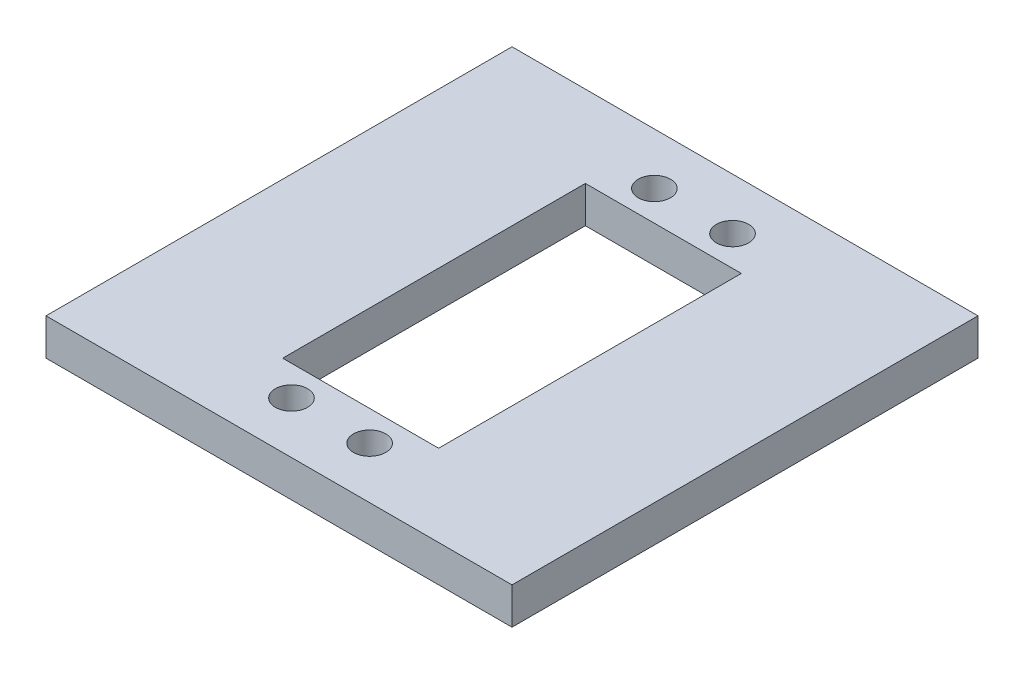
ISO-10303-21;
HEADER;
FILE_DESCRIPTION(('STEP AP214'),'2;1');
FILE_NAME('part.step','',(''),(''),'','','');
FILE_SCHEMA(('AUTOMOTIVE_DESIGN { 1 0 10303 214 1 1 1 1 }'));
ENDSEC;
DATA;
#1=APPLICATION_CONTEXT('core data for automotive mechanical design processes');
#2=APPLICATION_PROTOCOL_DEFINITION('international standard','automotive_design',2000,#1);
#3=PRODUCT_CONTEXT('',#1,'mechanical');
#4=PRODUCT('Part','Part','',(#3));
#5=PRODUCT_RELATED_PRODUCT_CATEGORY('part','',(#4));
#6=PRODUCT_DEFINITION_FORMATION('','',#4);
#7=PRODUCT_DEFINITION_CONTEXT('part definition',#1,'design');
#8=PRODUCT_DEFINITION('design','',#6,#7);
#9=PRODUCT_DEFINITION_SHAPE('','',#8);
#10=(LENGTH_UNIT() NAMED_UNIT(*) SI_UNIT(.MILLI.,.METRE.));
#11=(NAMED_UNIT(*) PLANE_ANGLE_UNIT() SI_UNIT($,.RADIAN.));
#12=(NAMED_UNIT(*) SI_UNIT($,.STERADIAN.) SOLID_ANGLE_UNIT());
#13=UNCERTAINTY_MEASURE_WITH_UNIT(LENGTH_MEASURE(1.E-05),#10,'distance_accuracy_value','');
#14=(GEOMETRIC_REPRESENTATION_CONTEXT(3) GLOBAL_UNCERTAINTY_ASSIGNED_CONTEXT((#13)) GLOBAL_UNIT_ASSIGNED_CONTEXT((#10,
#11,#12)) REPRESENTATION_CONTEXT('',''));
#15=CARTESIAN_POINT('',(0.,0.,0.));
#16=DIRECTION('',(0.,0.,1.));
#17=DIRECTION('',(1.,0.,0.));
#18=AXIS2_PLACEMENT_3D('',#15,#16,#17);
#19=CARTESIAN_POINT('',(31.75,5.,31.75));
#20=DIRECTION('',(-1.,0.,0.));
#21=DIRECTION('',(0.,0.,1.));
#22=AXIS2_PLACEMENT_3D('',#19,#20,#21);
#23=PLANE('',#22);
#24=DIRECTION('',(0.,0.,-1.));
#25=VECTOR('',#24,1.);
#26=CARTESIAN_POINT('',(31.75,0.,31.75));
#27=LINE('',#26,#25);
#28=CARTESIAN_POINT('',(31.75,0.,31.75));
#29=VERTEX_POINT('',#28);
#30=CARTESIAN_POINT('',(31.75,0.,-31.75));
#31=VERTEX_POINT('',#30);
#32=EDGE_CURVE('E157',#29,#31,#27,.T.);
#33=ORIENTED_EDGE('',*,*,#32,.T.);
#34=DIRECTION('',(0.,-1.,0.));
#35=VECTOR('',#34,1.);
#36=CARTESIAN_POINT('',(31.75,5.,-31.75));
#37=LINE('',#36,#35);
#38=CARTESIAN_POINT('',(31.75,5.,-31.75));
#39=VERTEX_POINT('',#38);
#40=EDGE_CURVE('E11',#39,#31,#37,.T.);
#41=ORIENTED_EDGE('',*,*,#40,.F.);
#42=DIRECTION('',(0.,0.,-1.));
#43=VECTOR('',#42,1.);
#44=CARTESIAN_POINT('',(31.75,5.,31.75));
#45=LINE('',#44,#43);
#46=CARTESIAN_POINT('',(31.75,5.,31.75));
#47=VERTEX_POINT('',#46);
#48=EDGE_CURVE('E163',#47,#39,#45,.T.);
#49=ORIENTED_EDGE('',*,*,#48,.F.);
#50=DIRECTION('',(0.,-1.,0.));
#51=VECTOR('',#50,1.);
#52=CARTESIAN_POINT('',(31.75,5.,31.75));
#53=LINE('',#52,#51);
#54=EDGE_CURVE('E177',#47,#29,#53,.T.);
#55=ORIENTED_EDGE('',*,*,#54,.T.);
#56=EDGE_LOOP('',(#33,#41,#49,#55));
#57=FACE_BOUND('',#56,.T.);
#58=ADVANCED_FACE('F45',(#57),#23,.F.);
#59=CARTESIAN_POINT('',(-31.75,5.,-31.75));
#60=DIRECTION('',(0.,0.,1.));
#61=DIRECTION('',(1.,0.,0.));
#62=AXIS2_PLACEMENT_3D('',#59,#60,#61);
#63=PLANE('',#62);
#64=DIRECTION('',(-1.,0.,0.));
#65=VECTOR('',#64,1.);
#66=CARTESIAN_POINT('',(-31.75,0.,-31.75));
#67=LINE('',#66,#65);
#68=CARTESIAN_POINT('',(-31.75,0.,-31.75));
#69=VERTEX_POINT('',#68);
#70=EDGE_CURVE('E181',#31,#69,#67,.T.);
#71=ORIENTED_EDGE('',*,*,#70,.T.);
#72=DIRECTION('',(0.,-1.,0.));
#73=VECTOR('',#72,1.);
#74=CARTESIAN_POINT('',(-31.75,5.,-31.75));
#75=LINE('',#74,#73);
#76=CARTESIAN_POINT('',(-31.75,5.,-31.75));
#77=VERTEX_POINT('',#76);
#78=EDGE_CURVE('E53',#77,#69,#75,.T.);
#79=ORIENTED_EDGE('',*,*,#78,.F.);
#80=DIRECTION('',(-1.,0.,0.));
#81=VECTOR('',#80,1.);
#82=CARTESIAN_POINT('',(-31.75,5.,-31.75));
#83=LINE('',#82,#81);
#84=EDGE_CURVE('E167',#39,#77,#83,.T.);
#85=ORIENTED_EDGE('',*,*,#84,.F.);
#86=ORIENTED_EDGE('',*,*,#40,.T.);
#87=EDGE_LOOP('',(#71,#79,#85,#86));
#88=FACE_BOUND('',#87,.T.);
#89=ADVANCED_FACE('F215',(#88),#63,.F.);
#90=CARTESIAN_POINT('',(-31.75,5.,31.75));
#91=DIRECTION('',(1.,0.,0.));
#92=DIRECTION('',(0.,0.,-1.));
#93=AXIS2_PLACEMENT_3D('',#90,#91,#92);
#94=PLANE('',#93);
#95=DIRECTION('',(0.,0.,1.));
#96=VECTOR('',#95,1.);
#97=CARTESIAN_POINT('',(-31.75,0.,31.75));
#98=LINE('',#97,#96);
#99=CARTESIAN_POINT('',(-31.75,0.,31.75));
#100=VERTEX_POINT('',#99);
#101=EDGE_CURVE('E184',#69,#100,#98,.T.);
#102=ORIENTED_EDGE('',*,*,#101,.T.);
#103=DIRECTION('',(0.,-1.,0.));
#104=VECTOR('',#103,1.);
#105=CARTESIAN_POINT('',(-31.75,5.,31.75));
#106=LINE('',#105,#104);
#107=CARTESIAN_POINT('',(-31.75,5.,31.75));
#108=VERTEX_POINT('',#107);
#109=EDGE_CURVE('E192',#108,#100,#106,.T.);
#110=ORIENTED_EDGE('',*,*,#109,.F.);
#111=DIRECTION('',(0.,0.,1.));
#112=VECTOR('',#111,1.);
#113=CARTESIAN_POINT('',(-31.75,5.,31.75));
#114=LINE('',#113,#112);
#115=EDGE_CURVE('E171',#77,#108,#114,.T.);
#116=ORIENTED_EDGE('',*,*,#115,.F.);
#117=ORIENTED_EDGE('',*,*,#78,.T.);
#118=EDGE_LOOP('',(#102,#110,#116,#117));
#119=FACE_BOUND('',#118,.T.);
#120=ADVANCED_FACE('F201',(#119),#94,.F.);
#121=CARTESIAN_POINT('',(-31.75,5.,31.75));
#122=DIRECTION('',(0.,0.,-1.));
#123=DIRECTION('',(-1.,0.,0.));
#124=AXIS2_PLACEMENT_3D('',#121,#122,#123);
#125=PLANE('',#124);
#126=DIRECTION('',(1.,0.,0.));
#127=VECTOR('',#126,1.);
#128=CARTESIAN_POINT('',(-31.75,0.,31.75));
#129=LINE('',#128,#127);
#130=EDGE_CURVE('E168',#100,#29,#129,.T.);
#131=ORIENTED_EDGE('',*,*,#130,.T.);
#132=ORIENTED_EDGE('',*,*,#54,.F.);
#133=DIRECTION('',(1.,0.,0.));
#134=VECTOR('',#133,1.);
#135=CARTESIAN_POINT('',(-31.75,5.,31.75));
#136=LINE('',#135,#134);
#137=EDGE_CURVE('E174',#108,#47,#136,.T.);
#138=ORIENTED_EDGE('',*,*,#137,.F.);
#139=ORIENTED_EDGE('',*,*,#109,.T.);
#140=EDGE_LOOP('',(#131,#132,#138,#139));
#141=FACE_BOUND('',#140,.T.);
#142=ADVANCED_FACE('F208',(#141),#125,.F.);
#143=CARTESIAN_POINT('',(0.,5.,0.));
#144=DIRECTION('',(0.,-1.,0.));
#145=DIRECTION('',(0.,0.,-1.));
#146=AXIS2_PLACEMENT_3D('',#143,#144,#145);
#147=PLANE('',#146);
#148=CARTESIAN_POINT('',(-5.325,5.,24.725));
#149=DIRECTION('',(0.,1.,0.));
#150=DIRECTION('',(0.,0.,1.));
#151=AXIS2_PLACEMENT_3D('',#148,#149,#150);
#152=CIRCLE('',#151,2.2);
#153=CARTESIAN_POINT('',(-5.325,5.,26.925));
#154=VERTEX_POINT('',#153);
#155=EDGE_CURVE('E286',#154,#154,#152,.T.);
#156=ORIENTED_EDGE('',*,*,#155,.F.);
#157=EDGE_LOOP('',(#156));
#158=FACE_BOUND('',#157,.T.);
#159=CARTESIAN_POINT('',(5.325,5.,24.725));
#160=DIRECTION('',(0.,1.,0.));
#161=DIRECTION('',(0.,0.,-1.));
#162=AXIS2_PLACEMENT_3D('',#159,#160,#161);
#163=CIRCLE('',#162,2.2);
#164=CARTESIAN_POINT('',(5.325,5.,22.525));
#165=VERTEX_POINT('',#164);
#166=EDGE_CURVE('E279',#165,#165,#163,.T.);
#167=ORIENTED_EDGE('',*,*,#166,.F.);
#168=EDGE_LOOP('',(#167));
#169=FACE_BOUND('',#168,.T.);
#170=CARTESIAN_POINT('',(-5.325,5.,-24.725));
#171=DIRECTION('',(0.,1.,0.));
#172=DIRECTION('',(0.,0.,-1.));
#173=AXIS2_PLACEMENT_3D('',#170,#171,#172);
#174=CIRCLE('',#173,2.2);
#175=CARTESIAN_POINT('',(-5.325,5.,-26.925));
#176=VERTEX_POINT('',#175);
#177=EDGE_CURVE('E269',#176,#176,#174,.T.);
#178=ORIENTED_EDGE('',*,*,#177,.F.);
#179=EDGE_LOOP('',(#178));
#180=FACE_BOUND('',#179,.T.);
#181=CARTESIAN_POINT('',(5.325,5.,-24.725));
#182=DIRECTION('',(0.,1.,0.));
#183=DIRECTION('',(0.,0.,1.));
#184=AXIS2_PLACEMENT_3D('',#181,#182,#183);
#185=CIRCLE('',#184,2.2);
#186=CARTESIAN_POINT('',(5.325,5.,-22.525));
#187=VERTEX_POINT('',#186);
#188=EDGE_CURVE('E148',#187,#187,#185,.T.);
#189=ORIENTED_EDGE('',*,*,#188,.F.);
#190=EDGE_LOOP('',(#189));
#191=FACE_BOUND('',#190,.T.);
#192=DIRECTION('',(-1.,0.,0.));
#193=VECTOR('',#192,1.);
#194=CARTESIAN_POINT('',(-10.625,5.,-20.625));
#195=LINE('',#194,#193);
#196=CARTESIAN_POINT('',(10.625,5.,-20.625));
#197=VERTEX_POINT('',#196);
#198=CARTESIAN_POINT('',(-10.625,5.,-20.625));
#199=VERTEX_POINT('',#198);
#200=EDGE_CURVE('E147',#197,#199,#195,.T.);
#201=ORIENTED_EDGE('',*,*,#200,.F.);
#202=DIRECTION('',(0.,0.,-1.));
#203=VECTOR('',#202,1.);
#204=CARTESIAN_POINT('',(10.625,5.,20.625));
#205=LINE('',#204,#203);
#206=CARTESIAN_POINT('',(10.625,5.,20.625));
#207=VERTEX_POINT('',#206);
#208=EDGE_CURVE('E60',#207,#197,#205,.T.);
#209=ORIENTED_EDGE('',*,*,#208,.F.);
#210=DIRECTION('',(1.,0.,0.));
#211=VECTOR('',#210,1.);
#212=CARTESIAN_POINT('',(-10.625,5.,20.625));
#213=LINE('',#212,#211);
#214=CARTESIAN_POINT('',(-10.625,5.,20.625));
#215=VERTEX_POINT('',#214);
#216=EDGE_CURVE('E131',#215,#207,#213,.T.);
#217=ORIENTED_EDGE('',*,*,#216,.F.);
#218=DIRECTION('',(0.,0.,1.));
#219=VECTOR('',#218,1.);
#220=CARTESIAN_POINT('',(-10.625,5.,20.625));
#221=LINE('',#220,#219);
#222=EDGE_CURVE('E135',#199,#215,#221,.T.);
#223=ORIENTED_EDGE('',*,*,#222,.F.);
#224=EDGE_LOOP('',(#201,#209,#217,#223));
#225=FACE_BOUND('',#224,.T.);
#226=ORIENTED_EDGE('',*,*,#48,.T.);
#227=ORIENTED_EDGE('',*,*,#84,.T.);
#228=ORIENTED_EDGE('',*,*,#115,.T.);
#229=ORIENTED_EDGE('',*,*,#137,.T.);
#230=EDGE_LOOP('',(#226,#227,#228,#229));
#231=FACE_BOUND('',#230,.T.);
#232=ADVANCED_FACE('F214',(#158,#169,#180,#191,#225,#231),#147,.F.);
#233=CARTESIAN_POINT('',(0.,0.,0.));
#234=DIRECTION('',(0.,-1.,0.));
#235=DIRECTION('',(0.,0.,-1.));
#236=AXIS2_PLACEMENT_3D('',#233,#234,#235);
#237=PLANE('',#236);
#238=CARTESIAN_POINT('',(-5.325,0.,24.725));
#239=DIRECTION('',(0.,1.,0.));
#240=DIRECTION('',(0.,0.,1.));
#241=AXIS2_PLACEMENT_3D('',#238,#239,#240);
#242=CIRCLE('',#241,2.2);
#243=CARTESIAN_POINT('',(-5.325,0.,26.925));
#244=VERTEX_POINT('',#243);
#245=EDGE_CURVE('E138',#244,#244,#242,.T.);
#246=ORIENTED_EDGE('',*,*,#245,.T.);
#247=EDGE_LOOP('',(#246));
#248=FACE_BOUND('',#247,.T.);
#249=CARTESIAN_POINT('',(5.325,0.,24.725));
#250=DIRECTION('',(0.,1.,0.));
#251=DIRECTION('',(0.,0.,-1.));
#252=AXIS2_PLACEMENT_3D('',#249,#250,#251);
#253=CIRCLE('',#252,2.2);
#254=CARTESIAN_POINT('',(5.325,0.,22.525));
#255=VERTEX_POINT('',#254);
#256=EDGE_CURVE('E283',#255,#255,#253,.T.);
#257=ORIENTED_EDGE('',*,*,#256,.T.);
#258=EDGE_LOOP('',(#257));
#259=FACE_BOUND('',#258,.T.);
#260=CARTESIAN_POINT('',(-5.325,0.,-24.725));
#261=DIRECTION('',(0.,1.,0.));
#262=DIRECTION('',(0.,0.,-1.));
#263=AXIS2_PLACEMENT_3D('',#260,#261,#262);
#264=CIRCLE('',#263,2.2);
#265=CARTESIAN_POINT('',(-5.325,0.,-26.925));
#266=VERTEX_POINT('',#265);
#267=EDGE_CURVE('E275',#266,#266,#264,.T.);
#268=ORIENTED_EDGE('',*,*,#267,.T.);
#269=EDGE_LOOP('',(#268));
#270=FACE_BOUND('',#269,.T.);
#271=CARTESIAN_POINT('',(5.325,0.,-24.725));
#272=DIRECTION('',(0.,1.,0.));
#273=DIRECTION('',(0.,0.,1.));
#274=AXIS2_PLACEMENT_3D('',#271,#272,#273);
#275=CIRCLE('',#274,2.2);
#276=CARTESIAN_POINT('',(5.325,0.,-22.525));
#277=VERTEX_POINT('',#276);
#278=EDGE_CURVE('E262',#277,#277,#275,.T.);
#279=ORIENTED_EDGE('',*,*,#278,.T.);
#280=EDGE_LOOP('',(#279));
#281=FACE_BOUND('',#280,.T.);
#282=DIRECTION('',(0.,0.,-1.));
#283=VECTOR('',#282,1.);
#284=CARTESIAN_POINT('',(10.625,0.,20.625));
#285=LINE('',#284,#283);
#286=CARTESIAN_POINT('',(10.625,0.,20.625));
#287=VERTEX_POINT('',#286);
#288=CARTESIAN_POINT('',(10.625,0.,-20.625));
#289=VERTEX_POINT('',#288);
#290=EDGE_CURVE('E112',#287,#289,#285,.T.);
#291=ORIENTED_EDGE('',*,*,#290,.T.);
#292=DIRECTION('',(-1.,0.,0.));
#293=VECTOR('',#292,1.);
#294=CARTESIAN_POINT('',(-10.625,0.,-20.625));
#295=LINE('',#294,#293);
#296=CARTESIAN_POINT('',(-10.625,0.,-20.625));
#297=VERTEX_POINT('',#296);
#298=EDGE_CURVE('E122',#289,#297,#295,.T.);
#299=ORIENTED_EDGE('',*,*,#298,.T.);
#300=DIRECTION('',(0.,0.,1.));
#301=VECTOR('',#300,1.);
#302=CARTESIAN_POINT('',(-10.625,0.,20.625));
#303=LINE('',#302,#301);
#304=CARTESIAN_POINT('',(-10.625,0.,20.625));
#305=VERTEX_POINT('',#304);
#306=EDGE_CURVE('E68',#297,#305,#303,.T.);
#307=ORIENTED_EDGE('',*,*,#306,.T.);
#308=DIRECTION('',(1.,0.,0.));
#309=VECTOR('',#308,1.);
#310=CARTESIAN_POINT('',(-10.625,0.,20.625));
#311=LINE('',#310,#309);
#312=EDGE_CURVE('E119',#305,#287,#311,.T.);
#313=ORIENTED_EDGE('',*,*,#312,.T.);
#314=EDGE_LOOP('',(#291,#299,#307,#313));
#315=FACE_BOUND('',#314,.T.);
#316=ORIENTED_EDGE('',*,*,#32,.F.);
#317=ORIENTED_EDGE('',*,*,#130,.F.);
#318=ORIENTED_EDGE('',*,*,#101,.F.);
#319=ORIENTED_EDGE('',*,*,#70,.F.);
#320=EDGE_LOOP('',(#316,#317,#318,#319));
#321=FACE_BOUND('',#320,.T.);
#322=ADVANCED_FACE('F127',(#248,#259,#270,#281,#315,#321),#237,.T.);
#323=CARTESIAN_POINT('',(10.625,0.,20.625));
#324=DIRECTION('',(1.,0.,0.));
#325=DIRECTION('',(0.,0.,-1.));
#326=AXIS2_PLACEMENT_3D('',#323,#324,#325);
#327=PLANE('',#326);
#328=ORIENTED_EDGE('',*,*,#208,.T.);
#329=DIRECTION('',(0.,1.,0.));
#330=VECTOR('',#329,1.);
#331=CARTESIAN_POINT('',(10.625,0.,-20.625));
#332=LINE('',#331,#330);
#333=EDGE_CURVE('E108',#289,#197,#332,.T.);
#334=ORIENTED_EDGE('',*,*,#333,.F.);
#335=ORIENTED_EDGE('',*,*,#290,.F.);
#336=DIRECTION('',(0.,1.,0.));
#337=VECTOR('',#336,1.);
#338=CARTESIAN_POINT('',(10.625,0.,20.625));
#339=LINE('',#338,#337);
#340=EDGE_CURVE('E154',#287,#207,#339,.T.);
#341=ORIENTED_EDGE('',*,*,#340,.T.);
#342=EDGE_LOOP('',(#328,#334,#335,#341));
#343=FACE_BOUND('',#342,.T.);
#344=ADVANCED_FACE('F110',(#343),#327,.F.);
#345=CARTESIAN_POINT('',(-10.625,0.,20.625));
#346=DIRECTION('',(0.,0.,1.));
#347=DIRECTION('',(1.,0.,0.));
#348=AXIS2_PLACEMENT_3D('',#345,#346,#347);
#349=PLANE('',#348);
#350=ORIENTED_EDGE('',*,*,#216,.T.);
#351=ORIENTED_EDGE('',*,*,#340,.F.);
#352=ORIENTED_EDGE('',*,*,#312,.F.);
#353=DIRECTION('',(0.,1.,0.));
#354=VECTOR('',#353,1.);
#355=CARTESIAN_POINT('',(-10.625,0.,20.625));
#356=LINE('',#355,#354);
#357=EDGE_CURVE('E158',#305,#215,#356,.T.);
#358=ORIENTED_EDGE('',*,*,#357,.T.);
#359=EDGE_LOOP('',(#350,#351,#352,#358));
#360=FACE_BOUND('',#359,.T.);
#361=ADVANCED_FACE('F233',(#360),#349,.F.);
#362=CARTESIAN_POINT('',(-10.625,0.,20.625));
#363=DIRECTION('',(-1.,0.,0.));
#364=DIRECTION('',(0.,0.,1.));
#365=AXIS2_PLACEMENT_3D('',#362,#363,#364);
#366=PLANE('',#365);
#367=ORIENTED_EDGE('',*,*,#222,.T.);
#368=ORIENTED_EDGE('',*,*,#357,.F.);
#369=ORIENTED_EDGE('',*,*,#306,.F.);
#370=DIRECTION('',(0.,1.,0.));
#371=VECTOR('',#370,1.);
#372=CARTESIAN_POINT('',(-10.625,0.,-20.625));
#373=LINE('',#372,#371);
#374=EDGE_CURVE('E118',#297,#199,#373,.T.);
#375=ORIENTED_EDGE('',*,*,#374,.T.);
#376=EDGE_LOOP('',(#367,#368,#369,#375));
#377=FACE_BOUND('',#376,.T.);
#378=ADVANCED_FACE('F237',(#377),#366,.F.);
#379=CARTESIAN_POINT('',(-10.625,0.,-20.625));
#380=DIRECTION('',(0.,0.,-1.));
#381=DIRECTION('',(-1.,0.,0.));
#382=AXIS2_PLACEMENT_3D('',#379,#380,#381);
#383=PLANE('',#382);
#384=ORIENTED_EDGE('',*,*,#200,.T.);
#385=ORIENTED_EDGE('',*,*,#374,.F.);
#386=ORIENTED_EDGE('',*,*,#298,.F.);
#387=ORIENTED_EDGE('',*,*,#333,.T.);
#388=EDGE_LOOP('',(#384,#385,#386,#387));
#389=FACE_BOUND('',#388,.T.);
#390=ADVANCED_FACE('F123',(#389),#383,.F.);
#391=CARTESIAN_POINT('',(5.325,0.,-24.725));
#392=DIRECTION('',(0.,1.,0.));
#393=DIRECTION('',(0.,0.,1.));
#394=AXIS2_PLACEMENT_3D('',#391,#392,#393);
#395=CYLINDRICAL_SURFACE('',#394,2.2);
#396=ORIENTED_EDGE('',*,*,#278,.F.);
#397=EDGE_LOOP('',(#396));
#398=FACE_BOUND('',#397,.T.);
#399=ORIENTED_EDGE('',*,*,#188,.T.);
#400=EDGE_LOOP('',(#399));
#401=FACE_BOUND('',#400,.T.);
#402=ADVANCED_FACE('F236',(#398,#401),#395,.F.);
#403=CARTESIAN_POINT('',(-5.325,0.,-24.725));
#404=DIRECTION('',(0.,1.,0.));
#405=DIRECTION('',(0.,0.,1.));
#406=AXIS2_PLACEMENT_3D('',#403,#404,#405);
#407=CYLINDRICAL_SURFACE('',#406,2.2);
#408=ORIENTED_EDGE('',*,*,#267,.F.);
#409=EDGE_LOOP('',(#408));
#410=FACE_BOUND('',#409,.T.);
#411=ORIENTED_EDGE('',*,*,#177,.T.);
#412=EDGE_LOOP('',(#411));
#413=FACE_BOUND('',#412,.T.);
#414=ADVANCED_FACE('F250',(#410,#413),#407,.F.);
#415=CARTESIAN_POINT('',(5.325,0.,24.725));
#416=DIRECTION('',(0.,1.,0.));
#417=DIRECTION('',(0.,0.,1.));
#418=AXIS2_PLACEMENT_3D('',#415,#416,#417);
#419=CYLINDRICAL_SURFACE('',#418,2.2);
#420=ORIENTED_EDGE('',*,*,#256,.F.);
#421=EDGE_LOOP('',(#420));
#422=FACE_BOUND('',#421,.T.);
#423=ORIENTED_EDGE('',*,*,#166,.T.);
#424=EDGE_LOOP('',(#423));
#425=FACE_BOUND('',#424,.T.);
#426=ADVANCED_FACE('F246',(#422,#425),#419,.F.);
#427=CARTESIAN_POINT('',(-5.325,0.,24.725));
#428=DIRECTION('',(0.,1.,0.));
#429=DIRECTION('',(0.,0.,1.));
#430=AXIS2_PLACEMENT_3D('',#427,#428,#429);
#431=CYLINDRICAL_SURFACE('',#430,2.2);
#432=ORIENTED_EDGE('',*,*,#245,.F.);
#433=EDGE_LOOP('',(#432));
#434=FACE_BOUND('',#433,.T.);
#435=ORIENTED_EDGE('',*,*,#155,.T.);
#436=EDGE_LOOP('',(#435));
#437=FACE_BOUND('',#436,.T.);
#438=ADVANCED_FACE('F243',(#434,#437),#431,.F.);
#439=CLOSED_SHELL('',(#58,#89,#120,#142,#232,#322,#344,#361,#378,#390,#402,#414,#426,#438));
#440=MANIFOLD_SOLID_BREP('B2',#439);
#441=ADVANCED_BREP_SHAPE_REPRESENTATION('',(#18,#440),#14);
#442=SHAPE_DEFINITION_REPRESENTATION(#9,#441);
ENDSEC;
END-ISO-10303-21;
